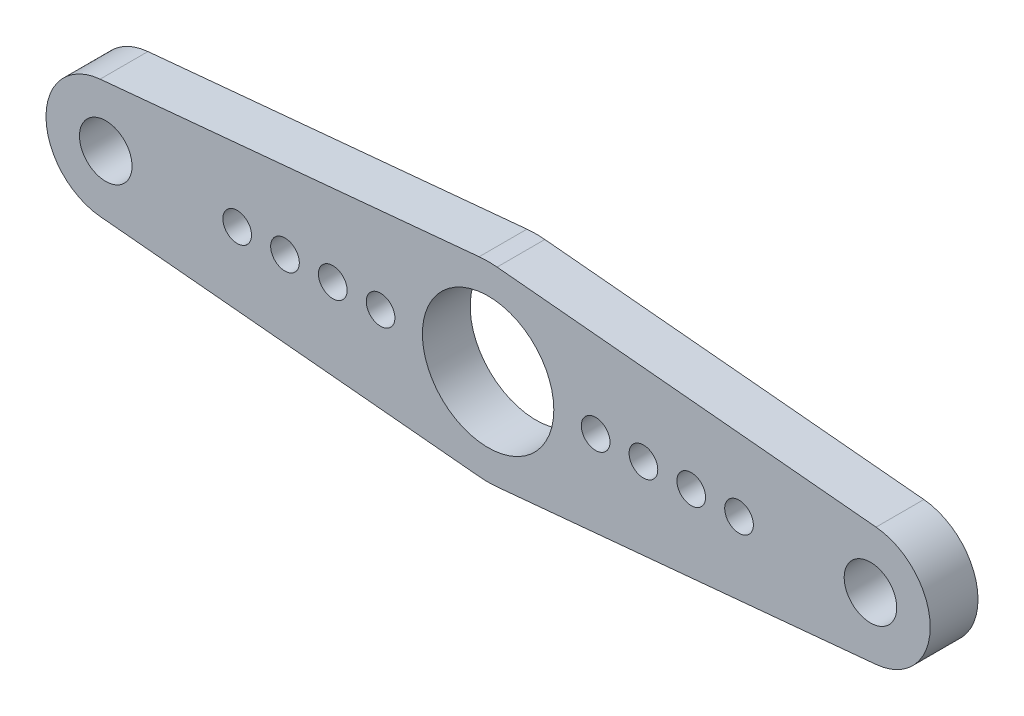
ISO-10303-21;
HEADER;
FILE_DESCRIPTION(('STEP AP214'),'2;1');
FILE_NAME('part.step','',(''),(''),'','','');
FILE_SCHEMA(('AUTOMOTIVE_DESIGN { 1 0 10303 214 1 1 1 1 }'));
ENDSEC;
DATA;
#1=APPLICATION_CONTEXT('core data for automotive mechanical design processes');
#2=APPLICATION_PROTOCOL_DEFINITION('international standard','automotive_design',2000,#1);
#3=PRODUCT_CONTEXT('',#1,'mechanical');
#4=PRODUCT('Part','Part','',(#3));
#5=PRODUCT_RELATED_PRODUCT_CATEGORY('part','',(#4));
#6=PRODUCT_DEFINITION_FORMATION('','',#4);
#7=PRODUCT_DEFINITION_CONTEXT('part definition',#1,'design');
#8=PRODUCT_DEFINITION('design','',#6,#7);
#9=PRODUCT_DEFINITION_SHAPE('','',#8);
#10=(LENGTH_UNIT() NAMED_UNIT(*) SI_UNIT(.MILLI.,.METRE.));
#11=(NAMED_UNIT(*) PLANE_ANGLE_UNIT() SI_UNIT($,.RADIAN.));
#12=(NAMED_UNIT(*) SI_UNIT($,.STERADIAN.) SOLID_ANGLE_UNIT());
#13=UNCERTAINTY_MEASURE_WITH_UNIT(LENGTH_MEASURE(1.E-05),#10,'distance_accuracy_value','');
#14=(GEOMETRIC_REPRESENTATION_CONTEXT(3) GLOBAL_UNCERTAINTY_ASSIGNED_CONTEXT((#13)) GLOBAL_UNIT_ASSIGNED_CONTEXT((#10,
#11,#12)) REPRESENTATION_CONTEXT('',''));
#15=CARTESIAN_POINT('',(0.,0.,0.));
#16=DIRECTION('',(0.,0.,1.));
#17=DIRECTION('',(1.,0.,0.));
#18=AXIS2_PLACEMENT_3D('',#15,#16,#17);
#19=CARTESIAN_POINT('',(-16.,0.,2.));
#20=DIRECTION('',(0.,0.,-1.));
#21=DIRECTION('',(-1.,0.,0.));
#22=AXIS2_PLACEMENT_3D('',#19,#20,#21);
#23=CYLINDRICAL_SURFACE('',#22,2.5);
#24=CARTESIAN_POINT('',(-16.,0.,0.));
#25=DIRECTION('',(0.,0.,1.));
#26=DIRECTION('',(1.,0.,0.));
#27=AXIS2_PLACEMENT_3D('',#24,#25,#26);
#28=CIRCLE('',#27,2.5);
#29=CARTESIAN_POINT('',(-16.234375,2.48898942532406,0.));
#30=VERTEX_POINT('',#29);
#31=CARTESIAN_POINT('',(-16.234375,-2.48898942532406,0.));
#32=VERTEX_POINT('',#31);
#33=EDGE_CURVE('E142',#30,#32,#28,.T.);
#34=ORIENTED_EDGE('',*,*,#33,.T.);
#35=DIRECTION('',(0.,0.,-1.));
#36=VECTOR('',#35,1.);
#37=CARTESIAN_POINT('',(-16.234375,-2.48898942532406,2.));
#38=LINE('',#37,#36);
#39=CARTESIAN_POINT('',(-16.234375,-2.48898942532406,2.));
#40=VERTEX_POINT('',#39);
#41=EDGE_CURVE('E11',#40,#32,#38,.T.);
#42=ORIENTED_EDGE('',*,*,#41,.F.);
#43=CARTESIAN_POINT('',(-16.,0.,2.));
#44=DIRECTION('',(0.,0.,1.));
#45=DIRECTION('',(1.,0.,0.));
#46=AXIS2_PLACEMENT_3D('',#43,#44,#45);
#47=CIRCLE('',#46,2.5);
#48=CARTESIAN_POINT('',(-16.234375,2.48898942532406,2.));
#49=VERTEX_POINT('',#48);
#50=EDGE_CURVE('E165',#49,#40,#47,.T.);
#51=ORIENTED_EDGE('',*,*,#50,.F.);
#52=DIRECTION('',(0.,0.,-1.));
#53=VECTOR('',#52,1.);
#54=CARTESIAN_POINT('',(-16.234375,2.48898942532406,2.));
#55=LINE('',#54,#53);
#56=EDGE_CURVE('E138',#49,#30,#55,.T.);
#57=ORIENTED_EDGE('',*,*,#56,.T.);
#58=EDGE_LOOP('',(#34,#42,#51,#57));
#59=FACE_BOUND('',#58,.T.);
#60=ADVANCED_FACE('F40',(#59),#23,.T.);
#61=CARTESIAN_POINT('',(-16.234375,-2.48898942532406,2.));
#62=DIRECTION('',(0.09375,0.995595770129625,0.));
#63=DIRECTION('',(-0.995595770129625,0.09375,0.));
#64=AXIS2_PLACEMENT_3D('',#61,#62,#63);
#65=PLANE('',#64);
#66=DIRECTION('',(0.995595770129625,-0.09375,0.));
#67=VECTOR('',#66,1.);
#68=CARTESIAN_POINT('',(-16.234375,-2.48898942532406,0.));
#69=LINE('',#68,#67);
#70=CARTESIAN_POINT('',(-0.375000000000002,-3.9823830805185,0.));
#71=VERTEX_POINT('',#70);
#72=EDGE_CURVE('E146',#32,#71,#69,.T.);
#73=ORIENTED_EDGE('',*,*,#72,.T.);
#74=DIRECTION('',(0.,0.,-1.));
#75=VECTOR('',#74,1.);
#76=CARTESIAN_POINT('',(-0.375000000000002,-3.9823830805185,2.));
#77=LINE('',#76,#75);
#78=CARTESIAN_POINT('',(-0.375000000000002,-3.9823830805185,2.));
#79=VERTEX_POINT('',#78);
#80=EDGE_CURVE('E49',#79,#71,#77,.T.);
#81=ORIENTED_EDGE('',*,*,#80,.F.);
#82=DIRECTION('',(0.995595770129625,-0.09375,0.));
#83=VECTOR('',#82,1.);
#84=CARTESIAN_POINT('',(-16.234375,-2.48898942532406,2.));
#85=LINE('',#84,#83);
#86=EDGE_CURVE('E100',#40,#79,#85,.T.);
#87=ORIENTED_EDGE('',*,*,#86,.F.);
#88=ORIENTED_EDGE('',*,*,#41,.T.);
#89=EDGE_LOOP('',(#73,#81,#87,#88));
#90=FACE_BOUND('',#89,.T.);
#91=ADVANCED_FACE('F326',(#90),#65,.F.);
#92=CARTESIAN_POINT('',(0.,0.,2.));
#93=DIRECTION('',(0.,0.,-1.));
#94=DIRECTION('',(-1.,0.,0.));
#95=AXIS2_PLACEMENT_3D('',#92,#93,#94);
#96=CYLINDRICAL_SURFACE('',#95,4.);
#97=CARTESIAN_POINT('',(0.,0.,0.));
#98=DIRECTION('',(0.,0.,1.));
#99=DIRECTION('',(1.,0.,0.));
#100=AXIS2_PLACEMENT_3D('',#97,#98,#99);
#101=CIRCLE('',#100,4.);
#102=CARTESIAN_POINT('',(0.375000000000001,-3.9823830805185,0.));
#103=VERTEX_POINT('',#102);
#104=EDGE_CURVE('E150',#71,#103,#101,.T.);
#105=ORIENTED_EDGE('',*,*,#104,.T.);
#106=DIRECTION('',(0.,0.,-1.));
#107=VECTOR('',#106,1.);
#108=CARTESIAN_POINT('',(0.375000000000001,-3.9823830805185,2.));
#109=LINE('',#108,#107);
#110=CARTESIAN_POINT('',(0.375000000000001,-3.9823830805185,2.));
#111=VERTEX_POINT('',#110);
#112=EDGE_CURVE('E176',#111,#103,#109,.T.);
#113=ORIENTED_EDGE('',*,*,#112,.F.);
#114=CARTESIAN_POINT('',(0.,0.,2.));
#115=DIRECTION('',(0.,0.,1.));
#116=DIRECTION('',(1.,0.,0.));
#117=AXIS2_PLACEMENT_3D('',#114,#115,#116);
#118=CIRCLE('',#117,4.);
#119=EDGE_CURVE('E187',#79,#111,#118,.T.);
#120=ORIENTED_EDGE('',*,*,#119,.F.);
#121=ORIENTED_EDGE('',*,*,#80,.T.);
#122=EDGE_LOOP('',(#105,#113,#120,#121));
#123=FACE_BOUND('',#122,.T.);
#124=ADVANCED_FACE('F185',(#123),#96,.T.);
#125=CARTESIAN_POINT('',(16.234375,-2.48898942532406,2.));
#126=DIRECTION('',(-0.0937500000000002,0.995595770129625,0.));
#127=DIRECTION('',(-0.995595770129625,-0.0937500000000002,0.));
#128=AXIS2_PLACEMENT_3D('',#125,#126,#127);
#129=PLANE('',#128);
#130=DIRECTION('',(0.995595770129625,0.0937500000000002,0.));
#131=VECTOR('',#130,1.);
#132=CARTESIAN_POINT('',(16.234375,-2.48898942532406,0.));
#133=LINE('',#132,#131);
#134=CARTESIAN_POINT('',(16.234375,-2.48898942532406,0.));
#135=VERTEX_POINT('',#134);
#136=EDGE_CURVE('E153',#103,#135,#133,.T.);
#137=ORIENTED_EDGE('',*,*,#136,.T.);
#138=DIRECTION('',(0.,0.,-1.));
#139=VECTOR('',#138,1.);
#140=CARTESIAN_POINT('',(16.234375,-2.48898942532406,2.));
#141=LINE('',#140,#139);
#142=CARTESIAN_POINT('',(16.234375,-2.48898942532406,2.));
#143=VERTEX_POINT('',#142);
#144=EDGE_CURVE('E172',#143,#135,#141,.T.);
#145=ORIENTED_EDGE('',*,*,#144,.F.);
#146=DIRECTION('',(0.995595770129625,0.0937500000000002,0.));
#147=VECTOR('',#146,1.);
#148=CARTESIAN_POINT('',(16.234375,-2.48898942532406,2.));
#149=LINE('',#148,#147);
#150=EDGE_CURVE('E200',#111,#143,#149,.T.);
#151=ORIENTED_EDGE('',*,*,#150,.F.);
#152=ORIENTED_EDGE('',*,*,#112,.T.);
#153=EDGE_LOOP('',(#137,#145,#151,#152));
#154=FACE_BOUND('',#153,.T.);
#155=ADVANCED_FACE('F195',(#154),#129,.F.);
#156=CARTESIAN_POINT('',(16.,0.,2.));
#157=DIRECTION('',(0.,0.,-1.));
#158=DIRECTION('',(-1.,0.,0.));
#159=AXIS2_PLACEMENT_3D('',#156,#157,#158);
#160=CYLINDRICAL_SURFACE('',#159,2.5);
#161=CARTESIAN_POINT('',(16.,0.,0.));
#162=DIRECTION('',(0.,0.,1.));
#163=DIRECTION('',(-1.,0.,0.));
#164=AXIS2_PLACEMENT_3D('',#161,#162,#163);
#165=CIRCLE('',#164,2.5);
#166=CARTESIAN_POINT('',(16.234375,2.48898942532407,0.));
#167=VERTEX_POINT('',#166);
#168=EDGE_CURVE('E156',#135,#167,#165,.T.);
#169=ORIENTED_EDGE('',*,*,#168,.T.);
#170=DIRECTION('',(0.,0.,-1.));
#171=VECTOR('',#170,1.);
#172=CARTESIAN_POINT('',(16.234375,2.48898942532407,2.));
#173=LINE('',#172,#171);
#174=CARTESIAN_POINT('',(16.234375,2.48898942532407,2.));
#175=VERTEX_POINT('',#174);
#176=EDGE_CURVE('E130',#175,#167,#173,.T.);
#177=ORIENTED_EDGE('',*,*,#176,.F.);
#178=CARTESIAN_POINT('',(16.,0.,2.));
#179=DIRECTION('',(0.,0.,1.));
#180=DIRECTION('',(-1.,0.,0.));
#181=AXIS2_PLACEMENT_3D('',#178,#179,#180);
#182=CIRCLE('',#181,2.5);
#183=EDGE_CURVE('E119',#143,#175,#182,.T.);
#184=ORIENTED_EDGE('',*,*,#183,.F.);
#185=ORIENTED_EDGE('',*,*,#144,.T.);
#186=EDGE_LOOP('',(#169,#177,#184,#185));
#187=FACE_BOUND('',#186,.T.);
#188=ADVANCED_FACE('F198',(#187),#160,.T.);
#189=CARTESIAN_POINT('',(16.234375,2.48898942532407,2.));
#190=DIRECTION('',(-0.0937499999999998,-0.995595770129625,0.));
#191=DIRECTION('',(0.995595770129625,-0.0937499999999998,0.));
#192=AXIS2_PLACEMENT_3D('',#189,#190,#191);
#193=PLANE('',#192);
#194=DIRECTION('',(-0.995595770129625,0.0937499999999998,0.));
#195=VECTOR('',#194,1.);
#196=CARTESIAN_POINT('',(16.234375,2.48898942532407,0.));
#197=LINE('',#196,#195);
#198=CARTESIAN_POINT('',(0.374999999999999,3.9823830805185,0.));
#199=VERTEX_POINT('',#198);
#200=EDGE_CURVE('E128',#167,#199,#197,.T.);
#201=ORIENTED_EDGE('',*,*,#200,.T.);
#202=DIRECTION('',(0.,0.,-1.));
#203=VECTOR('',#202,1.);
#204=CARTESIAN_POINT('',(0.374999999999999,3.9823830805185,2.));
#205=LINE('',#204,#203);
#206=CARTESIAN_POINT('',(0.374999999999999,3.9823830805185,2.));
#207=VERTEX_POINT('',#206);
#208=EDGE_CURVE('E125',#207,#199,#205,.T.);
#209=ORIENTED_EDGE('',*,*,#208,.F.);
#210=DIRECTION('',(-0.995595770129625,0.0937499999999998,0.));
#211=VECTOR('',#210,1.);
#212=CARTESIAN_POINT('',(16.234375,2.48898942532407,2.));
#213=LINE('',#212,#211);
#214=EDGE_CURVE('E113',#175,#207,#213,.T.);
#215=ORIENTED_EDGE('',*,*,#214,.F.);
#216=ORIENTED_EDGE('',*,*,#176,.T.);
#217=EDGE_LOOP('',(#201,#209,#215,#216));
#218=FACE_BOUND('',#217,.T.);
#219=ADVANCED_FACE('F126',(#218),#193,.F.);
#220=CARTESIAN_POINT('',(0.,0.,2.));
#221=DIRECTION('',(0.,0.,-1.));
#222=DIRECTION('',(-1.,0.,0.));
#223=AXIS2_PLACEMENT_3D('',#220,#221,#222);
#224=CYLINDRICAL_SURFACE('',#223,4.);
#225=CARTESIAN_POINT('',(0.,0.,0.));
#226=DIRECTION('',(0.,0.,1.));
#227=DIRECTION('',(1.,0.,0.));
#228=AXIS2_PLACEMENT_3D('',#225,#226,#227);
#229=CIRCLE('',#228,4.);
#230=CARTESIAN_POINT('',(-0.375,3.9823830805185,0.));
#231=VERTEX_POINT('',#230);
#232=EDGE_CURVE('E86',#199,#231,#229,.T.);
#233=ORIENTED_EDGE('',*,*,#232,.T.);
#234=DIRECTION('',(0.,0.,-1.));
#235=VECTOR('',#234,1.);
#236=CARTESIAN_POINT('',(-0.375,3.9823830805185,2.));
#237=LINE('',#236,#235);
#238=CARTESIAN_POINT('',(-0.375,3.9823830805185,2.));
#239=VERTEX_POINT('',#238);
#240=EDGE_CURVE('E131',#239,#231,#237,.T.);
#241=ORIENTED_EDGE('',*,*,#240,.F.);
#242=CARTESIAN_POINT('',(0.,0.,2.));
#243=DIRECTION('',(0.,0.,1.));
#244=DIRECTION('',(1.,0.,0.));
#245=AXIS2_PLACEMENT_3D('',#242,#243,#244);
#246=CIRCLE('',#245,4.);
#247=EDGE_CURVE('E117',#207,#239,#246,.T.);
#248=ORIENTED_EDGE('',*,*,#247,.F.);
#249=ORIENTED_EDGE('',*,*,#208,.T.);
#250=EDGE_LOOP('',(#233,#241,#248,#249));
#251=FACE_BOUND('',#250,.T.);
#252=ADVANCED_FACE('F133',(#251),#224,.T.);
#253=CARTESIAN_POINT('',(-16.234375,2.48898942532406,2.));
#254=DIRECTION('',(0.09375,-0.995595770129625,0.));
#255=DIRECTION('',(0.995595770129625,0.09375,0.));
#256=AXIS2_PLACEMENT_3D('',#253,#254,#255);
#257=PLANE('',#256);
#258=DIRECTION('',(-0.995595770129625,-0.09375,0.));
#259=VECTOR('',#258,1.);
#260=CARTESIAN_POINT('',(-16.234375,2.48898942532406,0.));
#261=LINE('',#260,#259);
#262=EDGE_CURVE('E92',#231,#30,#261,.T.);
#263=ORIENTED_EDGE('',*,*,#262,.T.);
#264=ORIENTED_EDGE('',*,*,#56,.F.);
#265=DIRECTION('',(-0.995595770129625,-0.09375,0.));
#266=VECTOR('',#265,1.);
#267=CARTESIAN_POINT('',(-16.234375,2.48898942532406,2.));
#268=LINE('',#267,#266);
#269=EDGE_CURVE('E57',#239,#49,#268,.T.);
#270=ORIENTED_EDGE('',*,*,#269,.F.);
#271=ORIENTED_EDGE('',*,*,#240,.T.);
#272=EDGE_LOOP('',(#263,#264,#270,#271));
#273=FACE_BOUND('',#272,.T.);
#274=ADVANCED_FACE('F304',(#273),#257,.F.);
#275=CARTESIAN_POINT('',(-16.,0.,2.));
#276=DIRECTION('',(0.,0.,1.));
#277=DIRECTION('',(1.,0.,0.));
#278=AXIS2_PLACEMENT_3D('',#275,#276,#277);
#279=PLANE('',#278);
#280=CARTESIAN_POINT('',(10.5,0.,2.));
#281=DIRECTION('',(0.,0.,1.));
#282=DIRECTION('',(-1.,0.,0.));
#283=AXIS2_PLACEMENT_3D('',#280,#281,#282);
#284=CIRCLE('',#283,0.6);
#285=CARTESIAN_POINT('',(9.9,0.,2.));
#286=VERTEX_POINT('',#285);
#287=EDGE_CURVE('E256',#286,#286,#284,.T.);
#288=ORIENTED_EDGE('',*,*,#287,.F.);
#289=EDGE_LOOP('',(#288));
#290=FACE_BOUND('',#289,.T.);
#291=CARTESIAN_POINT('',(4.5,0.,2.));
#292=DIRECTION('',(0.,0.,1.));
#293=DIRECTION('',(-1.,0.,0.));
#294=AXIS2_PLACEMENT_3D('',#291,#292,#293);
#295=CIRCLE('',#294,0.6);
#296=CARTESIAN_POINT('',(3.9,0.,2.));
#297=VERTEX_POINT('',#296);
#298=EDGE_CURVE('E255',#297,#297,#295,.T.);
#299=ORIENTED_EDGE('',*,*,#298,.F.);
#300=EDGE_LOOP('',(#299));
#301=FACE_BOUND('',#300,.T.);
#302=CARTESIAN_POINT('',(-10.5,0.,2.));
#303=DIRECTION('',(0.,0.,1.));
#304=DIRECTION('',(1.,0.,0.));
#305=AXIS2_PLACEMENT_3D('',#302,#303,#304);
#306=CIRCLE('',#305,0.6);
#307=CARTESIAN_POINT('',(-9.9,0.,2.));
#308=VERTEX_POINT('',#307);
#309=EDGE_CURVE('E265',#308,#308,#306,.T.);
#310=ORIENTED_EDGE('',*,*,#309,.F.);
#311=EDGE_LOOP('',(#310));
#312=FACE_BOUND('',#311,.T.);
#313=CARTESIAN_POINT('',(-8.5,0.,2.));
#314=DIRECTION('',(0.,0.,1.));
#315=DIRECTION('',(1.,0.,0.));
#316=AXIS2_PLACEMENT_3D('',#313,#314,#315);
#317=CIRCLE('',#316,0.6);
#318=CARTESIAN_POINT('',(-7.9,0.,2.));
#319=VERTEX_POINT('',#318);
#320=EDGE_CURVE('E273',#319,#319,#317,.T.);
#321=ORIENTED_EDGE('',*,*,#320,.F.);
#322=EDGE_LOOP('',(#321));
#323=FACE_BOUND('',#322,.T.);
#324=CARTESIAN_POINT('',(-16.,0.,2.));
#325=DIRECTION('',(0.,0.,1.));
#326=DIRECTION('',(1.,0.,0.));
#327=AXIS2_PLACEMENT_3D('',#324,#325,#326);
#328=CIRCLE('',#327,1.1);
#329=CARTESIAN_POINT('',(-14.9,0.,2.));
#330=VERTEX_POINT('',#329);
#331=EDGE_CURVE('E223',#330,#330,#328,.T.);
#332=ORIENTED_EDGE('',*,*,#331,.F.);
#333=EDGE_LOOP('',(#332));
#334=FACE_BOUND('',#333,.T.);
#335=CARTESIAN_POINT('',(16.,0.,2.));
#336=DIRECTION('',(0.,0.,1.));
#337=DIRECTION('',(-1.,0.,0.));
#338=AXIS2_PLACEMENT_3D('',#335,#336,#337);
#339=CIRCLE('',#338,1.1);
#340=CARTESIAN_POINT('',(14.9,0.,2.));
#341=VERTEX_POINT('',#340);
#342=EDGE_CURVE('E224',#341,#341,#339,.T.);
#343=ORIENTED_EDGE('',*,*,#342,.F.);
#344=EDGE_LOOP('',(#343));
#345=FACE_BOUND('',#344,.T.);
#346=CARTESIAN_POINT('',(-4.5,0.,2.));
#347=DIRECTION('',(0.,0.,1.));
#348=DIRECTION('',(1.,0.,0.));
#349=AXIS2_PLACEMENT_3D('',#346,#347,#348);
#350=CIRCLE('',#349,0.6);
#351=CARTESIAN_POINT('',(-3.9,0.,2.));
#352=VERTEX_POINT('',#351);
#353=EDGE_CURVE('E239',#352,#352,#350,.T.);
#354=ORIENTED_EDGE('',*,*,#353,.F.);
#355=EDGE_LOOP('',(#354));
#356=FACE_BOUND('',#355,.T.);
#357=CARTESIAN_POINT('',(-6.5,0.,2.));
#358=DIRECTION('',(0.,0.,1.));
#359=DIRECTION('',(1.,0.,0.));
#360=AXIS2_PLACEMENT_3D('',#357,#358,#359);
#361=CIRCLE('',#360,0.6);
#362=CARTESIAN_POINT('',(-5.9,0.,2.));
#363=VERTEX_POINT('',#362);
#364=EDGE_CURVE('E240',#363,#363,#361,.T.);
#365=ORIENTED_EDGE('',*,*,#364,.F.);
#366=EDGE_LOOP('',(#365));
#367=FACE_BOUND('',#366,.T.);
#368=CARTESIAN_POINT('',(8.5,0.,2.));
#369=DIRECTION('',(0.,0.,1.));
#370=DIRECTION('',(-1.,0.,0.));
#371=AXIS2_PLACEMENT_3D('',#368,#369,#370);
#372=CIRCLE('',#371,0.6);
#373=CARTESIAN_POINT('',(7.9,0.,2.));
#374=VERTEX_POINT('',#373);
#375=EDGE_CURVE('E287',#374,#374,#372,.T.);
#376=ORIENTED_EDGE('',*,*,#375,.F.);
#377=EDGE_LOOP('',(#376));
#378=FACE_BOUND('',#377,.T.);
#379=CARTESIAN_POINT('',(6.5,0.,2.));
#380=DIRECTION('',(0.,0.,1.));
#381=DIRECTION('',(-1.,0.,0.));
#382=AXIS2_PLACEMENT_3D('',#379,#380,#381);
#383=CIRCLE('',#382,0.6);
#384=CARTESIAN_POINT('',(5.9,0.,2.));
#385=VERTEX_POINT('',#384);
#386=EDGE_CURVE('E288',#385,#385,#383,.T.);
#387=ORIENTED_EDGE('',*,*,#386,.F.);
#388=EDGE_LOOP('',(#387));
#389=FACE_BOUND('',#388,.T.);
#390=CARTESIAN_POINT('',(0.,0.,2.));
#391=DIRECTION('',(0.,0.,1.));
#392=DIRECTION('',(1.,0.,0.));
#393=AXIS2_PLACEMENT_3D('',#390,#391,#392);
#394=CIRCLE('',#393,2.75);
#395=CARTESIAN_POINT('',(2.75,0.,2.));
#396=VERTEX_POINT('',#395);
#397=EDGE_CURVE('E214',#396,#396,#394,.T.);
#398=ORIENTED_EDGE('',*,*,#397,.F.);
#399=EDGE_LOOP('',(#398));
#400=FACE_BOUND('',#399,.T.);
#401=ORIENTED_EDGE('',*,*,#50,.T.);
#402=ORIENTED_EDGE('',*,*,#86,.T.);
#403=ORIENTED_EDGE('',*,*,#119,.T.);
#404=ORIENTED_EDGE('',*,*,#150,.T.);
#405=ORIENTED_EDGE('',*,*,#183,.T.);
#406=ORIENTED_EDGE('',*,*,#214,.T.);
#407=ORIENTED_EDGE('',*,*,#247,.T.);
#408=ORIENTED_EDGE('',*,*,#269,.T.);
#409=EDGE_LOOP('',(#401,#402,#403,#404,#405,#406,#407,#408));
#410=FACE_BOUND('',#409,.T.);
#411=ADVANCED_FACE('F115',(#290,#301,#312,#323,#334,#345,#356,#367,#378,#389,#400,#410),#279,.T.);
#412=CARTESIAN_POINT('',(-16.,0.,0.));
#413=DIRECTION('',(0.,0.,1.));
#414=DIRECTION('',(1.,0.,0.));
#415=AXIS2_PLACEMENT_3D('',#412,#413,#414);
#416=PLANE('',#415);
#417=CARTESIAN_POINT('',(10.5,0.,0.));
#418=DIRECTION('',(0.,0.,1.));
#419=DIRECTION('',(1.,0.,0.));
#420=AXIS2_PLACEMENT_3D('',#417,#418,#419);
#421=CIRCLE('',#420,0.6);
#422=CARTESIAN_POINT('',(11.1,0.,0.));
#423=VERTEX_POINT('',#422);
#424=EDGE_CURVE('E251',#423,#423,#421,.F.);
#425=ORIENTED_EDGE('',*,*,#424,.F.);
#426=EDGE_LOOP('',(#425));
#427=FACE_BOUND('',#426,.T.);
#428=CARTESIAN_POINT('',(4.5,0.,0.));
#429=DIRECTION('',(0.,0.,1.));
#430=DIRECTION('',(1.,0.,0.));
#431=AXIS2_PLACEMENT_3D('',#428,#429,#430);
#432=CIRCLE('',#431,0.6);
#433=CARTESIAN_POINT('',(5.1,0.,0.));
#434=VERTEX_POINT('',#433);
#435=EDGE_CURVE('E261',#434,#434,#432,.F.);
#436=ORIENTED_EDGE('',*,*,#435,.F.);
#437=EDGE_LOOP('',(#436));
#438=FACE_BOUND('',#437,.T.);
#439=CARTESIAN_POINT('',(-10.5,0.,0.));
#440=DIRECTION('',(0.,0.,1.));
#441=DIRECTION('',(1.,0.,0.));
#442=AXIS2_PLACEMENT_3D('',#439,#440,#441);
#443=CIRCLE('',#442,0.6);
#444=CARTESIAN_POINT('',(-9.9,0.,0.));
#445=VERTEX_POINT('',#444);
#446=EDGE_CURVE('E269',#445,#445,#443,.F.);
#447=ORIENTED_EDGE('',*,*,#446,.F.);
#448=EDGE_LOOP('',(#447));
#449=FACE_BOUND('',#448,.T.);
#450=CARTESIAN_POINT('',(-8.5,0.,0.));
#451=DIRECTION('',(0.,0.,1.));
#452=DIRECTION('',(1.,0.,0.));
#453=AXIS2_PLACEMENT_3D('',#450,#451,#452);
#454=CIRCLE('',#453,0.6);
#455=CARTESIAN_POINT('',(-7.9,0.,0.));
#456=VERTEX_POINT('',#455);
#457=EDGE_CURVE('E244',#456,#456,#454,.F.);
#458=ORIENTED_EDGE('',*,*,#457,.F.);
#459=EDGE_LOOP('',(#458));
#460=FACE_BOUND('',#459,.T.);
#461=CARTESIAN_POINT('',(-16.,0.,0.));
#462=DIRECTION('',(0.,0.,1.));
#463=DIRECTION('',(1.,0.,0.));
#464=AXIS2_PLACEMENT_3D('',#461,#462,#463);
#465=CIRCLE('',#464,1.1);
#466=CARTESIAN_POINT('',(-14.9,0.,0.));
#467=VERTEX_POINT('',#466);
#468=EDGE_CURVE('E218',#467,#467,#465,.F.);
#469=ORIENTED_EDGE('',*,*,#468,.F.);
#470=EDGE_LOOP('',(#469));
#471=FACE_BOUND('',#470,.T.);
#472=CARTESIAN_POINT('',(16.,0.,0.));
#473=DIRECTION('',(0.,0.,1.));
#474=DIRECTION('',(1.,0.,0.));
#475=AXIS2_PLACEMENT_3D('',#472,#473,#474);
#476=CIRCLE('',#475,1.1);
#477=CARTESIAN_POINT('',(17.1,0.,0.));
#478=VERTEX_POINT('',#477);
#479=EDGE_CURVE('E219',#478,#478,#476,.F.);
#480=ORIENTED_EDGE('',*,*,#479,.F.);
#481=EDGE_LOOP('',(#480));
#482=FACE_BOUND('',#481,.T.);
#483=CARTESIAN_POINT('',(-4.5,0.,0.));
#484=DIRECTION('',(0.,0.,1.));
#485=DIRECTION('',(1.,0.,0.));
#486=AXIS2_PLACEMENT_3D('',#483,#484,#485);
#487=CIRCLE('',#486,0.6);
#488=CARTESIAN_POINT('',(-3.9,0.,0.));
#489=VERTEX_POINT('',#488);
#490=EDGE_CURVE('E228',#489,#489,#487,.F.);
#491=ORIENTED_EDGE('',*,*,#490,.F.);
#492=EDGE_LOOP('',(#491));
#493=FACE_BOUND('',#492,.T.);
#494=CARTESIAN_POINT('',(-6.5,0.,0.));
#495=DIRECTION('',(0.,0.,1.));
#496=DIRECTION('',(1.,0.,0.));
#497=AXIS2_PLACEMENT_3D('',#494,#495,#496);
#498=CIRCLE('',#497,0.6);
#499=CARTESIAN_POINT('',(-5.9,0.,0.));
#500=VERTEX_POINT('',#499);
#501=EDGE_CURVE('E235',#500,#500,#498,.F.);
#502=ORIENTED_EDGE('',*,*,#501,.F.);
#503=EDGE_LOOP('',(#502));
#504=FACE_BOUND('',#503,.T.);
#505=CARTESIAN_POINT('',(8.5,0.,0.));
#506=DIRECTION('',(0.,0.,1.));
#507=DIRECTION('',(1.,0.,0.));
#508=AXIS2_PLACEMENT_3D('',#505,#506,#507);
#509=CIRCLE('',#508,0.6);
#510=CARTESIAN_POINT('',(9.1,0.,0.));
#511=VERTEX_POINT('',#510);
#512=EDGE_CURVE('E260',#511,#511,#509,.F.);
#513=ORIENTED_EDGE('',*,*,#512,.F.);
#514=EDGE_LOOP('',(#513));
#515=FACE_BOUND('',#514,.T.);
#516=CARTESIAN_POINT('',(6.5,0.,0.));
#517=DIRECTION('',(0.,0.,1.));
#518=DIRECTION('',(1.,0.,0.));
#519=AXIS2_PLACEMENT_3D('',#516,#517,#518);
#520=CIRCLE('',#519,0.6);
#521=CARTESIAN_POINT('',(7.1,0.,0.));
#522=VERTEX_POINT('',#521);
#523=EDGE_CURVE('E283',#522,#522,#520,.F.);
#524=ORIENTED_EDGE('',*,*,#523,.F.);
#525=EDGE_LOOP('',(#524));
#526=FACE_BOUND('',#525,.T.);
#527=CARTESIAN_POINT('',(0.,0.,0.));
#528=DIRECTION('',(0.,0.,1.));
#529=DIRECTION('',(1.,0.,0.));
#530=AXIS2_PLACEMENT_3D('',#527,#528,#529);
#531=CIRCLE('',#530,2.75);
#532=CARTESIAN_POINT('',(2.75,0.,0.));
#533=VERTEX_POINT('',#532);
#534=EDGE_CURVE('E147',#533,#533,#531,.F.);
#535=ORIENTED_EDGE('',*,*,#534,.F.);
#536=EDGE_LOOP('',(#535));
#537=FACE_BOUND('',#536,.T.);
#538=ORIENTED_EDGE('',*,*,#33,.F.);
#539=ORIENTED_EDGE('',*,*,#262,.F.);
#540=ORIENTED_EDGE('',*,*,#232,.F.);
#541=ORIENTED_EDGE('',*,*,#200,.F.);
#542=ORIENTED_EDGE('',*,*,#168,.F.);
#543=ORIENTED_EDGE('',*,*,#136,.F.);
#544=ORIENTED_EDGE('',*,*,#104,.F.);
#545=ORIENTED_EDGE('',*,*,#72,.F.);
#546=EDGE_LOOP('',(#538,#539,#540,#541,#542,#543,#544,#545));
#547=FACE_BOUND('',#546,.T.);
#548=ADVANCED_FACE('F191',(#427,#438,#449,#460,#471,#482,#493,#504,#515,#526,#537,#547),#416,.F.);
#549=CARTESIAN_POINT('',(0.,0.,-7.77817459305202));
#550=DIRECTION('',(0.,0.,1.));
#551=DIRECTION('',(1.,0.,0.));
#552=AXIS2_PLACEMENT_3D('',#549,#550,#551);
#553=CYLINDRICAL_SURFACE('',#552,2.75);
#554=ORIENTED_EDGE('',*,*,#534,.T.);
#555=EDGE_LOOP('',(#554));
#556=FACE_BOUND('',#555,.T.);
#557=ORIENTED_EDGE('',*,*,#397,.T.);
#558=EDGE_LOOP('',(#557));
#559=FACE_BOUND('',#558,.T.);
#560=ADVANCED_FACE('F311',(#556,#559),#553,.F.);
#561=CARTESIAN_POINT('',(6.5,0.,-7.77817459305202));
#562=DIRECTION('',(0.,0.,1.));
#563=DIRECTION('',(1.,0.,0.));
#564=AXIS2_PLACEMENT_3D('',#561,#562,#563);
#565=CYLINDRICAL_SURFACE('',#564,0.6);
#566=ORIENTED_EDGE('',*,*,#523,.T.);
#567=EDGE_LOOP('',(#566));
#568=FACE_BOUND('',#567,.T.);
#569=ORIENTED_EDGE('',*,*,#386,.T.);
#570=EDGE_LOOP('',(#569));
#571=FACE_BOUND('',#570,.T.);
#572=ADVANCED_FACE('F313',(#568,#571),#565,.F.);
#573=CARTESIAN_POINT('',(8.5,0.,-7.77817459305202));
#574=DIRECTION('',(0.,0.,1.));
#575=DIRECTION('',(1.,0.,0.));
#576=AXIS2_PLACEMENT_3D('',#573,#574,#575);
#577=CYLINDRICAL_SURFACE('',#576,0.6);
#578=ORIENTED_EDGE('',*,*,#512,.T.);
#579=EDGE_LOOP('',(#578));
#580=FACE_BOUND('',#579,.T.);
#581=ORIENTED_EDGE('',*,*,#375,.T.);
#582=EDGE_LOOP('',(#581));
#583=FACE_BOUND('',#582,.T.);
#584=ADVANCED_FACE('F300',(#580,#583),#577,.F.);
#585=CARTESIAN_POINT('',(-6.5,0.,-7.77817459305202));
#586=DIRECTION('',(0.,0.,1.));
#587=DIRECTION('',(1.,0.,0.));
#588=AXIS2_PLACEMENT_3D('',#585,#586,#587);
#589=CYLINDRICAL_SURFACE('',#588,0.6);
#590=ORIENTED_EDGE('',*,*,#501,.T.);
#591=EDGE_LOOP('',(#590));
#592=FACE_BOUND('',#591,.T.);
#593=ORIENTED_EDGE('',*,*,#364,.T.);
#594=EDGE_LOOP('',(#593));
#595=FACE_BOUND('',#594,.T.);
#596=ADVANCED_FACE('F402',(#592,#595),#589,.F.);
#597=CARTESIAN_POINT('',(-4.5,0.,-7.77817459305202));
#598=DIRECTION('',(0.,0.,1.));
#599=DIRECTION('',(1.,0.,0.));
#600=AXIS2_PLACEMENT_3D('',#597,#598,#599);
#601=CYLINDRICAL_SURFACE('',#600,0.6);
#602=ORIENTED_EDGE('',*,*,#490,.T.);
#603=EDGE_LOOP('',(#602));
#604=FACE_BOUND('',#603,.T.);
#605=ORIENTED_EDGE('',*,*,#353,.T.);
#606=EDGE_LOOP('',(#605));
#607=FACE_BOUND('',#606,.T.);
#608=ADVANCED_FACE('F412',(#604,#607),#601,.F.);
#609=CARTESIAN_POINT('',(16.,0.,-7.77817459305202));
#610=DIRECTION('',(0.,0.,1.));
#611=DIRECTION('',(1.,0.,0.));
#612=AXIS2_PLACEMENT_3D('',#609,#610,#611);
#613=CYLINDRICAL_SURFACE('',#612,1.1);
#614=ORIENTED_EDGE('',*,*,#479,.T.);
#615=EDGE_LOOP('',(#614));
#616=FACE_BOUND('',#615,.T.);
#617=ORIENTED_EDGE('',*,*,#342,.T.);
#618=EDGE_LOOP('',(#617));
#619=FACE_BOUND('',#618,.T.);
#620=ADVANCED_FACE('F422',(#616,#619),#613,.F.);
#621=CARTESIAN_POINT('',(-16.,0.,-7.77817459305202));
#622=DIRECTION('',(0.,0.,1.));
#623=DIRECTION('',(1.,0.,0.));
#624=AXIS2_PLACEMENT_3D('',#621,#622,#623);
#625=CYLINDRICAL_SURFACE('',#624,1.1);
#626=ORIENTED_EDGE('',*,*,#468,.T.);
#627=EDGE_LOOP('',(#626));
#628=FACE_BOUND('',#627,.T.);
#629=ORIENTED_EDGE('',*,*,#331,.T.);
#630=EDGE_LOOP('',(#629));
#631=FACE_BOUND('',#630,.T.);
#632=ADVANCED_FACE('F432',(#628,#631),#625,.F.);
#633=CARTESIAN_POINT('',(-8.5,0.,-7.77817459305202));
#634=DIRECTION('',(0.,0.,1.));
#635=DIRECTION('',(1.,0.,0.));
#636=AXIS2_PLACEMENT_3D('',#633,#634,#635);
#637=CYLINDRICAL_SURFACE('',#636,0.6);
#638=ORIENTED_EDGE('',*,*,#457,.T.);
#639=EDGE_LOOP('',(#638));
#640=FACE_BOUND('',#639,.T.);
#641=ORIENTED_EDGE('',*,*,#320,.T.);
#642=EDGE_LOOP('',(#641));
#643=FACE_BOUND('',#642,.T.);
#644=ADVANCED_FACE('F441',(#640,#643),#637,.F.);
#645=CARTESIAN_POINT('',(-10.5,0.,-7.77817459305202));
#646=DIRECTION('',(0.,0.,1.));
#647=DIRECTION('',(1.,0.,0.));
#648=AXIS2_PLACEMENT_3D('',#645,#646,#647);
#649=CYLINDRICAL_SURFACE('',#648,0.6);
#650=ORIENTED_EDGE('',*,*,#446,.T.);
#651=EDGE_LOOP('',(#650));
#652=FACE_BOUND('',#651,.T.);
#653=ORIENTED_EDGE('',*,*,#309,.T.);
#654=EDGE_LOOP('',(#653));
#655=FACE_BOUND('',#654,.T.);
#656=ADVANCED_FACE('F451',(#652,#655),#649,.F.);
#657=CARTESIAN_POINT('',(4.5,0.,-7.77817459305202));
#658=DIRECTION('',(0.,0.,1.));
#659=DIRECTION('',(1.,0.,0.));
#660=AXIS2_PLACEMENT_3D('',#657,#658,#659);
#661=CYLINDRICAL_SURFACE('',#660,0.6);
#662=ORIENTED_EDGE('',*,*,#435,.T.);
#663=EDGE_LOOP('',(#662));
#664=FACE_BOUND('',#663,.T.);
#665=ORIENTED_EDGE('',*,*,#298,.T.);
#666=EDGE_LOOP('',(#665));
#667=FACE_BOUND('',#666,.T.);
#668=ADVANCED_FACE('F461',(#664,#667),#661,.F.);
#669=CARTESIAN_POINT('',(10.5,0.,-7.77817459305202));
#670=DIRECTION('',(0.,0.,1.));
#671=DIRECTION('',(1.,0.,0.));
#672=AXIS2_PLACEMENT_3D('',#669,#670,#671);
#673=CYLINDRICAL_SURFACE('',#672,0.6);
#674=ORIENTED_EDGE('',*,*,#424,.T.);
#675=EDGE_LOOP('',(#674));
#676=FACE_BOUND('',#675,.T.);
#677=ORIENTED_EDGE('',*,*,#287,.T.);
#678=EDGE_LOOP('',(#677));
#679=FACE_BOUND('',#678,.T.);
#680=ADVANCED_FACE('F471',(#676,#679),#673,.F.);
#681=CLOSED_SHELL('',(#60,#91,#124,#155,#188,#219,#252,#274,#411,#548,#560,#572,#584,#596,#608,
#620,#632,#644,#656,#668,#680));
#682=MANIFOLD_SOLID_BREP('B2',#681);
#683=ADVANCED_BREP_SHAPE_REPRESENTATION('',(#18,#682),#14);
#684=SHAPE_DEFINITION_REPRESENTATION(#9,#683);
ENDSEC;
END-ISO-10303-21;
